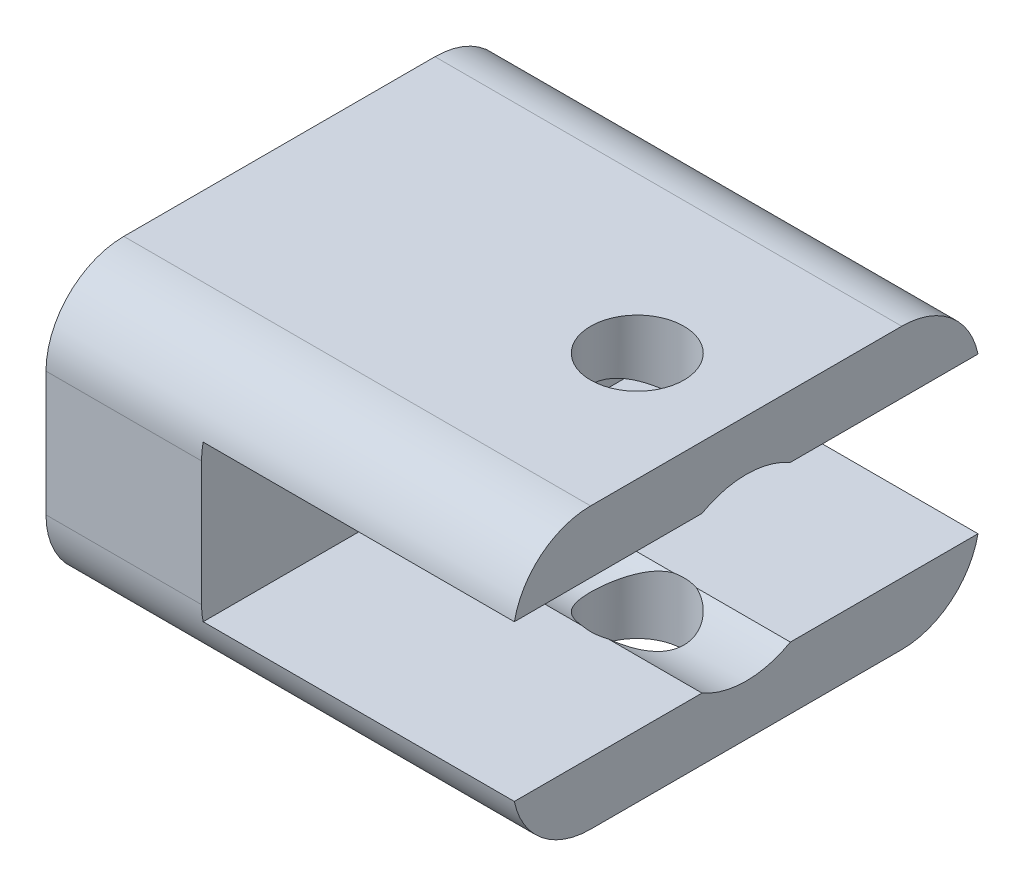
ISO-10303-21;
HEADER;
FILE_DESCRIPTION(('STEP AP214'),'2;1');
FILE_NAME('part.step','',(''),(''),'','','');
FILE_SCHEMA(('AUTOMOTIVE_DESIGN { 1 0 10303 214 1 1 1 1 }'));
ENDSEC;
DATA;
#1=APPLICATION_CONTEXT('core data for automotive mechanical design processes');
#2=APPLICATION_PROTOCOL_DEFINITION('international standard','automotive_design',2000,#1);
#3=PRODUCT_CONTEXT('',#1,'mechanical');
#4=PRODUCT('Part','Part','',(#3));
#5=PRODUCT_RELATED_PRODUCT_CATEGORY('part','',(#4));
#6=PRODUCT_DEFINITION_FORMATION('','',#4);
#7=PRODUCT_DEFINITION_CONTEXT('part definition',#1,'design');
#8=PRODUCT_DEFINITION('design','',#6,#7);
#9=PRODUCT_DEFINITION_SHAPE('','',#8);
#10=(LENGTH_UNIT() NAMED_UNIT(*) SI_UNIT(.MILLI.,.METRE.));
#11=(NAMED_UNIT(*) PLANE_ANGLE_UNIT() SI_UNIT($,.RADIAN.));
#12=(NAMED_UNIT(*) SI_UNIT($,.STERADIAN.) SOLID_ANGLE_UNIT());
#13=UNCERTAINTY_MEASURE_WITH_UNIT(LENGTH_MEASURE(1.E-05),#10,'distance_accuracy_value','');
#14=(GEOMETRIC_REPRESENTATION_CONTEXT(3) GLOBAL_UNCERTAINTY_ASSIGNED_CONTEXT((#13)) GLOBAL_UNIT_ASSIGNED_CONTEXT((#10,
#11,#12)) REPRESENTATION_CONTEXT('',''));
#15=CARTESIAN_POINT('',(0.,0.,0.));
#16=DIRECTION('',(0.,0.,1.));
#17=DIRECTION('',(1.,0.,0.));
#18=AXIS2_PLACEMENT_3D('',#15,#16,#17);
#19=CARTESIAN_POINT('',(10.,9.,15.));
#20=DIRECTION('',(1.,0.,0.));
#21=DIRECTION('',(0.,0.,-1.));
#22=AXIS2_PLACEMENT_3D('',#19,#20,#21);
#23=CYLINDRICAL_SURFACE('',#22,5.75);
#24=DIRECTION('',(1.,0.,0.));
#25=VECTOR('',#24,1.);
#26=CARTESIAN_POINT('',(10.,14.,17.8394541729001));
#27=LINE('',#26,#25);
#28=CARTESIAN_POINT('',(23.9682458365518,14.,17.8394541729001));
#29=VERTEX_POINT('',#28);
#30=CARTESIAN_POINT('',(30.,14.,17.8394541729001));
#31=VERTEX_POINT('',#30);
#32=EDGE_CURVE('E314',#29,#31,#27,.T.);
#33=ORIENTED_EDGE('',*,*,#32,.F.);
#34=CARTESIAN_POINT('',(23.9682458365518,14.,17.8394541729001));
#35=CARTESIAN_POINT('',(24.1320278859983,14.0316901820973,17.7836041525472));
#36=CARTESIAN_POINT('',(24.2894197609395,14.0699565687723,17.7141271284749));
#37=CARTESIAN_POINT('',(24.5884116763139,14.1541284087631,17.5506697656784));
#38=CARTESIAN_POINT('',(24.7300354991613,14.2000220901265,17.4567270624655));
#39=CARTESIAN_POINT('',(24.9947147808843,14.2939649872431,17.247126184123));
#40=CARTESIAN_POINT('',(25.1178092523469,14.3420093898147,17.1315148178157));
#41=CARTESIAN_POINT('',(25.3434550181591,14.4354151123317,16.8806069518322));
#42=CARTESIAN_POINT('',(25.4459942070961,14.4807748402032,16.7452989328942));
#43=CARTESIAN_POINT('',(25.6304103852107,14.5654859160931,16.4531605240063));
#44=CARTESIAN_POINT('',(25.7115504984142,14.6046081292717,16.2957940384179));
#45=CARTESIAN_POINT('',(25.8453895095648,14.6705673597498,15.9670400037451));
#46=CARTESIAN_POINT('',(25.8981172991026,14.6974168525569,15.7956669026088));
#47=CARTESIAN_POINT('',(25.9687818455782,14.7337026977883,15.4612260161125));
#48=CARTESIAN_POINT('',(25.9895388674149,14.7445465015041,15.2989070707829));
#49=CARTESIAN_POINT('',(26.0043083071319,14.7522445273858,14.9727472607448));
#50=CARTESIAN_POINT('',(25.9983318877482,14.749104588564,14.8089070597609));
#51=CARTESIAN_POINT('',(25.961511416091,14.7299949870763,14.4979661850838));
#52=CARTESIAN_POINT('',(25.9326519657824,14.7150495686035,14.3505595781304));
#53=CARTESIAN_POINT('',(25.853815231662,14.6749988347003,14.0629986883217));
#54=CARTESIAN_POINT('',(25.8038371513468,14.6498931360697,13.9228446792268));
#55=CARTESIAN_POINT('',(25.6824149958699,14.590612155831,13.6479441088223));
#56=CARTESIAN_POINT('',(25.6102571926257,14.5561405803477,13.513578839036));
#57=CARTESIAN_POINT('',(25.4473397716739,14.481489920095,13.2583082457945));
#58=CARTESIAN_POINT('',(25.3565633937789,14.4413057029558,13.1374152022474));
#59=CARTESIAN_POINT('',(25.1477981779779,14.3540255359892,12.8988756105851));
#60=CARTESIAN_POINT('',(25.0279338889306,14.3066507627992,12.7829718927738));
#61=CARTESIAN_POINT('',(24.7703948256299,14.2136772221812,12.5723861307345));
#62=CARTESIAN_POINT('',(24.6327435669187,14.1680762114808,12.4776765102836));
#63=CARTESIAN_POINT('',(24.4054371295366,14.1021169933735,12.3478915142216));
#64=CARTESIAN_POINT('',(24.3209603574319,14.0794089569746,12.3047997294767));
#65=CARTESIAN_POINT('',(24.147708354298,14.0371282583402,12.2265921480366));
#66=CARTESIAN_POINT('',(24.058935466988,14.0175539110998,12.1914720606345));
#67=CARTESIAN_POINT('',(23.9682458365518,14.,12.1605458270999));
#68=B_SPLINE_CURVE_WITH_KNOTS('',3,(#34,#35,#36,#37,#38,#39,#40,#41,#42,#43,#44,#45,#46,#47,#48,
#49,#50,#51,#52,#53,#54,#55,#56,#57,#58,#59,#60,#61,#62,#63,#64,#65,#66,#67),.UNSPECIFIED.,.F.,
.F.,(4,2,2,2,2,2,2,2,2,2,2,2,2,2,2,2,4),(0.,0.526399614421645,1.05199420373622,1.57646621899253,
2.10124620461427,2.64225177590212,3.18270617262085,3.67201392293233,4.16111737843767,
4.61190838547287,5.062716395911,5.52989804028133,5.99750209565819,6.51532177569366,
7.03246373742701,7.3245794789891,7.61653761659993),.UNSPECIFIED.);
#69=CARTESIAN_POINT('',(23.9682458365518,14.,12.1605458270999));
#70=VERTEX_POINT('',#69);
#71=EDGE_CURVE('E245',#29,#70,#68,.T.);
#72=ORIENTED_EDGE('',*,*,#71,.T.);
#73=DIRECTION('',(1.,0.,0.));
#74=VECTOR('',#73,1.);
#75=CARTESIAN_POINT('',(10.,14.,12.1605458270999));
#76=LINE('',#75,#74);
#77=CARTESIAN_POINT('',(30.,14.,12.1605458270999));
#78=VERTEX_POINT('',#77);
#79=EDGE_CURVE('E311',#78,#70,#76,.F.);
#80=ORIENTED_EDGE('',*,*,#79,.F.);
#81=CARTESIAN_POINT('',(30.,9.,15.));
#82=DIRECTION('',(1.,0.,0.));
#83=DIRECTION('',(0.,0.,-1.));
#84=AXIS2_PLACEMENT_3D('',#81,#82,#83);
#85=CIRCLE('',#84,5.75);
#86=EDGE_CURVE('E315',#78,#31,#85,.T.);
#87=ORIENTED_EDGE('',*,*,#86,.T.);
#88=EDGE_LOOP('',(#33,#72,#80,#87));
#89=FACE_BOUND('',#88,.T.);
#90=ADVANCED_FACE('F33',(#89),#23,.F.);
#91=CARTESIAN_POINT('',(0.,4.,0.));
#92=DIRECTION('',(0.,-1.,0.));
#93=DIRECTION('',(0.,0.,-1.));
#94=AXIS2_PLACEMENT_3D('',#91,#92,#93);
#95=PLANE('',#94);
#96=DIRECTION('',(0.,0.,1.));
#97=VECTOR('',#96,1.);
#98=CARTESIAN_POINT('',(30.,4.,0.));
#99=LINE('',#98,#97);
#100=CARTESIAN_POINT('',(30.,4.,0.101020514433644));
#101=VERTEX_POINT('',#100);
#102=CARTESIAN_POINT('',(30.,4.,12.1605458270999));
#103=VERTEX_POINT('',#102);
#104=EDGE_CURVE('E230',#101,#103,#99,.T.);
#105=ORIENTED_EDGE('',*,*,#104,.F.);
#106=DIRECTION('',(1.,0.,0.));
#107=VECTOR('',#106,1.);
#108=CARTESIAN_POINT('',(30.,4.,0.101020514433644));
#109=LINE('',#108,#107);
#110=CARTESIAN_POINT('',(10.,4.,0.101020514433644));
#111=VERTEX_POINT('',#110);
#112=EDGE_CURVE('E384',#101,#111,#109,.F.);
#113=ORIENTED_EDGE('',*,*,#112,.T.);
#114=DIRECTION('',(0.,0.,-1.));
#115=VECTOR('',#114,1.);
#116=CARTESIAN_POINT('',(10.,4.,0.));
#117=LINE('',#116,#115);
#118=CARTESIAN_POINT('',(10.,4.,12.0606123086602));
#119=VERTEX_POINT('',#118);
#120=EDGE_CURVE('E209',#119,#111,#117,.T.);
#121=ORIENTED_EDGE('',*,*,#120,.F.);
#122=DIRECTION('',(1.,0.,0.));
#123=VECTOR('',#122,1.);
#124=CARTESIAN_POINT('',(10.,4.,12.0606123086602));
#125=LINE('',#124,#123);
#126=CARTESIAN_POINT('',(22.4000000000001,4.,12.0606123086602));
#127=VERTEX_POINT('',#126);
#128=EDGE_CURVE('E188',#119,#127,#125,.T.);
#129=ORIENTED_EDGE('',*,*,#128,.T.);
#130=CARTESIAN_POINT('',(23.,4.,15.));
#131=DIRECTION('',(0.,-1.,0.));
#132=DIRECTION('',(0.,0.,-1.));
#133=AXIS2_PLACEMENT_3D('',#130,#131,#132);
#134=CIRCLE('',#133,2.99999999999999);
#135=CARTESIAN_POINT('',(23.9682458365518,4.,12.1605458270999));
#136=VERTEX_POINT('',#135);
#137=EDGE_CURVE('E172',#127,#136,#134,.T.);
#138=ORIENTED_EDGE('',*,*,#137,.T.);
#139=DIRECTION('',(1.,0.,0.));
#140=VECTOR('',#139,1.);
#141=CARTESIAN_POINT('',(10.,4.,12.1605458270999));
#142=LINE('',#141,#140);
#143=EDGE_CURVE('E185',#136,#103,#142,.T.);
#144=ORIENTED_EDGE('',*,*,#143,.T.);
#145=EDGE_LOOP('',(#105,#113,#121,#129,#138,#144));
#146=FACE_BOUND('',#145,.T.);
#147=ADVANCED_FACE('F184',(#146),#95,.F.);
#148=CARTESIAN_POINT('',(30.,14.,0.));
#149=DIRECTION('',(0.,1.,0.));
#150=DIRECTION('',(0.,0.,1.));
#151=AXIS2_PLACEMENT_3D('',#148,#149,#150);
#152=PLANE('',#151);
#153=DIRECTION('',(0.,0.,-1.));
#154=VECTOR('',#153,1.);
#155=CARTESIAN_POINT('',(30.,14.,0.));
#156=LINE('',#155,#154);
#157=CARTESIAN_POINT('',(30.,14.,29.8989794855664));
#158=VERTEX_POINT('',#157);
#159=EDGE_CURVE('E208',#158,#31,#156,.T.);
#160=ORIENTED_EDGE('',*,*,#159,.F.);
#161=DIRECTION('',(-1.,0.,0.));
#162=VECTOR('',#161,1.);
#163=CARTESIAN_POINT('',(30.,14.,29.8989794855664));
#164=LINE('',#163,#162);
#165=CARTESIAN_POINT('',(10.,14.,29.8989794855664));
#166=VERTEX_POINT('',#165);
#167=EDGE_CURVE('E11',#158,#166,#164,.T.);
#168=ORIENTED_EDGE('',*,*,#167,.T.);
#169=DIRECTION('',(0.,0.,-1.));
#170=VECTOR('',#169,1.);
#171=CARTESIAN_POINT('',(10.,14.,0.));
#172=LINE('',#171,#170);
#173=CARTESIAN_POINT('',(10.,14.,17.8394541729001));
#174=VERTEX_POINT('',#173);
#175=EDGE_CURVE('E198',#166,#174,#172,.T.);
#176=ORIENTED_EDGE('',*,*,#175,.T.);
#177=CARTESIAN_POINT('',(22.0317541634482,14.,17.8394541729001));
#178=VERTEX_POINT('',#177);
#179=EDGE_CURVE('E200',#174,#178,#27,.T.);
#180=ORIENTED_EDGE('',*,*,#179,.T.);
#181=CARTESIAN_POINT('',(23.,14.,15.));
#182=DIRECTION('',(0.,1.,0.));
#183=DIRECTION('',(0.,0.,1.));
#184=AXIS2_PLACEMENT_3D('',#181,#182,#183);
#185=CIRCLE('',#184,2.99999999999999);
#186=EDGE_CURVE('E324',#178,#29,#185,.T.);
#187=ORIENTED_EDGE('',*,*,#186,.T.);
#188=ORIENTED_EDGE('',*,*,#32,.T.);
#189=EDGE_LOOP('',(#160,#168,#176,#180,#187,#188));
#190=FACE_BOUND('',#189,.T.);
#191=ADVANCED_FACE('F284',(#190),#152,.F.);
#192=CARTESIAN_POINT('',(10.,9.,15.));
#193=DIRECTION('',(1.,0.,0.));
#194=DIRECTION('',(0.,0.,-1.));
#195=AXIS2_PLACEMENT_3D('',#192,#193,#194);
#196=PLANE('',#195);
#197=DIRECTION('',(0.,-1.,0.));
#198=VECTOR('',#197,1.);
#199=CARTESIAN_POINT('',(10.,18.,0.));
#200=LINE('',#199,#198);
#201=CARTESIAN_POINT('',(10.,13.,0.));
#202=VERTEX_POINT('',#201);
#203=CARTESIAN_POINT('',(10.,5.,0.));
#204=VERTEX_POINT('',#203);
#205=EDGE_CURVE('E219',#202,#204,#200,.T.);
#206=ORIENTED_EDGE('',*,*,#205,.F.);
#207=CARTESIAN_POINT('',(10.,13.,5.));
#208=DIRECTION('',(1.,0.,0.));
#209=DIRECTION('',(0.,0.,-1.));
#210=AXIS2_PLACEMENT_3D('',#207,#208,#209);
#211=CIRCLE('',#210,5.);
#212=CARTESIAN_POINT('',(10.,14.,0.101020514433644));
#213=VERTEX_POINT('',#212);
#214=EDGE_CURVE('E400',#202,#213,#211,.T.);
#215=ORIENTED_EDGE('',*,*,#214,.T.);
#216=CARTESIAN_POINT('',(10.,14.,12.1605458270999));
#217=VERTEX_POINT('',#216);
#218=EDGE_CURVE('E194',#217,#213,#172,.T.);
#219=ORIENTED_EDGE('',*,*,#218,.F.);
#220=CARTESIAN_POINT('',(10.,9.,15.));
#221=DIRECTION('',(-1.,0.,0.));
#222=DIRECTION('',(0.,0.,1.));
#223=AXIS2_PLACEMENT_3D('',#220,#221,#222);
#224=CIRCLE('',#223,5.75);
#225=EDGE_CURVE('E335',#217,#174,#224,.T.);
#226=ORIENTED_EDGE('',*,*,#225,.T.);
#227=ORIENTED_EDGE('',*,*,#175,.F.);
#228=CARTESIAN_POINT('',(10.,13.,25.));
#229=DIRECTION('',(1.,0.,0.));
#230=DIRECTION('',(0.,0.,-1.));
#231=AXIS2_PLACEMENT_3D('',#228,#229,#230);
#232=CIRCLE('',#231,5.);
#233=CARTESIAN_POINT('',(10.,13.,30.));
#234=VERTEX_POINT('',#233);
#235=EDGE_CURVE('E405',#166,#234,#232,.T.);
#236=ORIENTED_EDGE('',*,*,#235,.T.);
#237=DIRECTION('',(0.,-1.,0.));
#238=VECTOR('',#237,1.);
#239=CARTESIAN_POINT('',(10.,18.,30.));
#240=LINE('',#239,#238);
#241=CARTESIAN_POINT('',(10.,5.,30.));
#242=VERTEX_POINT('',#241);
#243=EDGE_CURVE('E214',#234,#242,#240,.T.);
#244=ORIENTED_EDGE('',*,*,#243,.T.);
#245=CARTESIAN_POINT('',(10.,5.,25.));
#246=DIRECTION('',(1.,0.,0.));
#247=DIRECTION('',(0.,0.,-1.));
#248=AXIS2_PLACEMENT_3D('',#245,#246,#247);
#249=CIRCLE('',#248,5.);
#250=CARTESIAN_POINT('',(10.,4.,29.8989794855664));
#251=VERTEX_POINT('',#250);
#252=EDGE_CURVE('E374',#242,#251,#249,.T.);
#253=ORIENTED_EDGE('',*,*,#252,.T.);
#254=CARTESIAN_POINT('',(10.,4.,17.9393876913398));
#255=VERTEX_POINT('',#254);
#256=EDGE_CURVE('E215',#251,#255,#117,.T.);
#257=ORIENTED_EDGE('',*,*,#256,.T.);
#258=CARTESIAN_POINT('',(10.,9.,15.));
#259=DIRECTION('',(1.,0.,0.));
#260=DIRECTION('',(0.,0.,-1.));
#261=AXIS2_PLACEMENT_3D('',#258,#259,#260);
#262=CIRCLE('',#261,5.8);
#263=EDGE_CURVE('E222',#255,#119,#262,.T.);
#264=ORIENTED_EDGE('',*,*,#263,.T.);
#265=ORIENTED_EDGE('',*,*,#120,.T.);
#266=CARTESIAN_POINT('',(10.,5.,5.));
#267=DIRECTION('',(1.,0.,0.));
#268=DIRECTION('',(0.,0.,-1.));
#269=AXIS2_PLACEMENT_3D('',#266,#267,#268);
#270=CIRCLE('',#269,5.);
#271=EDGE_CURVE('E402',#111,#204,#270,.T.);
#272=ORIENTED_EDGE('',*,*,#271,.T.);
#273=EDGE_LOOP('',(#206,#215,#219,#226,#227,#236,#244,#253,#257,#264,#265,#272));
#274=FACE_BOUND('',#273,.T.);
#275=ADVANCED_FACE('F372',(#274),#196,.T.);
#276=ORIENTED_EDGE('',*,*,#256,.F.);
#277=DIRECTION('',(-1.,0.,0.));
#278=VECTOR('',#277,1.);
#279=CARTESIAN_POINT('',(10.,4.,29.8989794855664));
#280=LINE('',#279,#278);
#281=CARTESIAN_POINT('',(30.,4.,29.8989794855664));
#282=VERTEX_POINT('',#281);
#283=EDGE_CURVE('E41',#251,#282,#280,.F.);
#284=ORIENTED_EDGE('',*,*,#283,.T.);
#285=CARTESIAN_POINT('',(30.,4.,17.8394541729001));
#286=VERTEX_POINT('',#285);
#287=EDGE_CURVE('E233',#286,#282,#99,.T.);
#288=ORIENTED_EDGE('',*,*,#287,.F.);
#289=DIRECTION('',(1.,0.,0.));
#290=VECTOR('',#289,1.);
#291=CARTESIAN_POINT('',(10.,4.,17.8394541729001));
#292=LINE('',#291,#290);
#293=CARTESIAN_POINT('',(23.9682458365518,4.,17.8394541729001));
#294=VERTEX_POINT('',#293);
#295=EDGE_CURVE('E195',#286,#294,#292,.F.);
#296=ORIENTED_EDGE('',*,*,#295,.T.);
#297=CARTESIAN_POINT('',(23.,4.,15.));
#298=DIRECTION('',(0.,-1.,0.));
#299=DIRECTION('',(0.,0.,-1.));
#300=AXIS2_PLACEMENT_3D('',#297,#298,#299);
#301=CIRCLE('',#300,2.99999999999999);
#302=CARTESIAN_POINT('',(22.4000000007489,4.,17.9393876914927));
#303=VERTEX_POINT('',#302);
#304=EDGE_CURVE('E175',#294,#303,#301,.T.);
#305=ORIENTED_EDGE('',*,*,#304,.T.);
#306=DIRECTION('',(1.,0.,0.));
#307=VECTOR('',#306,1.);
#308=CARTESIAN_POINT('',(10.,4.,17.9393876913398));
#309=LINE('',#308,#307);
#310=EDGE_CURVE('E225',#255,#303,#309,.T.);
#311=ORIENTED_EDGE('',*,*,#310,.F.);
#312=EDGE_LOOP('',(#276,#284,#288,#296,#305,#311));
#313=FACE_BOUND('',#312,.T.);
#314=ADVANCED_FACE('F286',(#313),#95,.F.);
#315=CARTESIAN_POINT('',(30.,4.,30.));
#316=DIRECTION('',(0.,0.,1.));
#317=DIRECTION('',(1.,0.,0.));
#318=AXIS2_PLACEMENT_3D('',#315,#316,#317);
#319=PLANE('',#318);
#320=DIRECTION('',(0.,-1.,0.));
#321=VECTOR('',#320,1.);
#322=CARTESIAN_POINT('',(0.,4.,30.));
#323=LINE('',#322,#321);
#324=CARTESIAN_POINT('',(0.,13.,30.));
#325=VERTEX_POINT('',#324);
#326=CARTESIAN_POINT('',(0.,5.,30.));
#327=VERTEX_POINT('',#326);
#328=EDGE_CURVE('E232',#325,#327,#323,.T.);
#329=ORIENTED_EDGE('',*,*,#328,.T.);
#330=DIRECTION('',(-1.,0.,0.));
#331=VECTOR('',#330,1.);
#332=CARTESIAN_POINT('',(30.,5.,30.));
#333=LINE('',#332,#331);
#334=EDGE_CURVE('E379',#327,#242,#333,.F.);
#335=ORIENTED_EDGE('',*,*,#334,.T.);
#336=ORIENTED_EDGE('',*,*,#243,.F.);
#337=DIRECTION('',(1.,0.,0.));
#338=VECTOR('',#337,1.);
#339=CARTESIAN_POINT('',(0.,13.,30.));
#340=LINE('',#339,#338);
#341=EDGE_CURVE('E380',#234,#325,#340,.F.);
#342=ORIENTED_EDGE('',*,*,#341,.T.);
#343=EDGE_LOOP('',(#329,#335,#336,#342));
#344=FACE_BOUND('',#343,.T.);
#345=ADVANCED_FACE('F441',(#344),#319,.T.);
#346=CARTESIAN_POINT('',(30.,4.,0.));
#347=DIRECTION('',(1.,0.,0.));
#348=DIRECTION('',(0.,0.,-1.));
#349=AXIS2_PLACEMENT_3D('',#346,#347,#348);
#350=PLANE('',#349);
#351=DIRECTION('',(0.,0.,1.));
#352=VECTOR('',#351,1.);
#353=CARTESIAN_POINT('',(30.,0.,0.));
#354=LINE('',#353,#352);
#355=CARTESIAN_POINT('',(30.,0.,5.));
#356=VERTEX_POINT('',#355);
#357=CARTESIAN_POINT('',(30.,0.,25.));
#358=VERTEX_POINT('',#357);
#359=EDGE_CURVE('E236',#356,#358,#354,.T.);
#360=ORIENTED_EDGE('',*,*,#359,.F.);
#361=CARTESIAN_POINT('',(30.,5.,5.));
#362=DIRECTION('',(1.,0.,0.));
#363=DIRECTION('',(0.,0.,-1.));
#364=AXIS2_PLACEMENT_3D('',#361,#362,#363);
#365=CIRCLE('',#364,5.);
#366=EDGE_CURVE('E48',#356,#101,#365,.T.);
#367=ORIENTED_EDGE('',*,*,#366,.T.);
#368=ORIENTED_EDGE('',*,*,#104,.T.);
#369=EDGE_CURVE('E193',#286,#103,#85,.T.);
#370=ORIENTED_EDGE('',*,*,#369,.F.);
#371=ORIENTED_EDGE('',*,*,#287,.T.);
#372=CARTESIAN_POINT('',(30.,5.,25.));
#373=DIRECTION('',(1.,0.,0.));
#374=DIRECTION('',(0.,0.,-1.));
#375=AXIS2_PLACEMENT_3D('',#372,#373,#374);
#376=CIRCLE('',#375,5.);
#377=EDGE_CURVE('E378',#282,#358,#376,.T.);
#378=ORIENTED_EDGE('',*,*,#377,.T.);
#379=EDGE_LOOP('',(#360,#367,#368,#370,#371,#378));
#380=FACE_BOUND('',#379,.T.);
#381=ADVANCED_FACE('F540',(#380),#350,.T.);
#382=CARTESIAN_POINT('',(0.,4.,0.));
#383=DIRECTION('',(0.,0.,-1.));
#384=DIRECTION('',(-1.,0.,0.));
#385=AXIS2_PLACEMENT_3D('',#382,#383,#384);
#386=PLANE('',#385);
#387=DIRECTION('',(0.,-1.,0.));
#388=VECTOR('',#387,1.);
#389=CARTESIAN_POINT('',(0.,4.,0.));
#390=LINE('',#389,#388);
#391=CARTESIAN_POINT('',(0.,13.,0.));
#392=VERTEX_POINT('',#391);
#393=CARTESIAN_POINT('',(0.,5.,0.));
#394=VERTEX_POINT('',#393);
#395=EDGE_CURVE('E239',#392,#394,#390,.T.);
#396=ORIENTED_EDGE('',*,*,#395,.F.);
#397=DIRECTION('',(-1.,0.,0.));
#398=VECTOR('',#397,1.);
#399=CARTESIAN_POINT('',(30.,13.,0.));
#400=LINE('',#399,#398);
#401=EDGE_CURVE('E407',#392,#202,#400,.F.);
#402=ORIENTED_EDGE('',*,*,#401,.T.);
#403=ORIENTED_EDGE('',*,*,#205,.T.);
#404=DIRECTION('',(1.,0.,0.));
#405=VECTOR('',#404,1.);
#406=CARTESIAN_POINT('',(0.,5.,0.));
#407=LINE('',#406,#405);
#408=EDGE_CURVE('E409',#204,#394,#407,.F.);
#409=ORIENTED_EDGE('',*,*,#408,.T.);
#410=EDGE_LOOP('',(#396,#402,#403,#409));
#411=FACE_BOUND('',#410,.T.);
#412=ADVANCED_FACE('F549',(#411),#386,.T.);
#413=CARTESIAN_POINT('',(0.,4.,30.));
#414=DIRECTION('',(-1.,0.,0.));
#415=DIRECTION('',(0.,0.,1.));
#416=AXIS2_PLACEMENT_3D('',#413,#414,#415);
#417=PLANE('',#416);
#418=CARTESIAN_POINT('',(0.,9.,15.));
#419=DIRECTION('',(-1.,0.,0.));
#420=DIRECTION('',(0.,0.,1.));
#421=AXIS2_PLACEMENT_3D('',#418,#419,#420);
#422=CIRCLE('',#421,2.75);
#423=CARTESIAN_POINT('',(0.,9.,17.75));
#424=VERTEX_POINT('',#423);
#425=EDGE_CURVE('E330',#424,#424,#422,.T.);
#426=ORIENTED_EDGE('',*,*,#425,.F.);
#427=EDGE_LOOP('',(#426));
#428=FACE_BOUND('',#427,.T.);
#429=DIRECTION('',(0.,0.,1.));
#430=VECTOR('',#429,1.);
#431=CARTESIAN_POINT('',(0.,18.,30.));
#432=LINE('',#431,#430);
#433=CARTESIAN_POINT('',(0.,18.,5.));
#434=VERTEX_POINT('',#433);
#435=CARTESIAN_POINT('',(0.,18.,25.));
#436=VERTEX_POINT('',#435);
#437=EDGE_CURVE('E211',#434,#436,#432,.T.);
#438=ORIENTED_EDGE('',*,*,#437,.F.);
#439=CARTESIAN_POINT('',(0.,13.,5.));
#440=DIRECTION('',(-1.,0.,0.));
#441=DIRECTION('',(0.,0.,1.));
#442=AXIS2_PLACEMENT_3D('',#439,#440,#441);
#443=CIRCLE('',#442,5.);
#444=EDGE_CURVE('E411',#434,#392,#443,.T.);
#445=ORIENTED_EDGE('',*,*,#444,.T.);
#446=ORIENTED_EDGE('',*,*,#395,.T.);
#447=CARTESIAN_POINT('',(0.,5.,5.));
#448=DIRECTION('',(-1.,0.,0.));
#449=DIRECTION('',(0.,0.,1.));
#450=AXIS2_PLACEMENT_3D('',#447,#448,#449);
#451=CIRCLE('',#450,5.);
#452=CARTESIAN_POINT('',(0.,0.,5.));
#453=VERTEX_POINT('',#452);
#454=EDGE_CURVE('E413',#394,#453,#451,.T.);
#455=ORIENTED_EDGE('',*,*,#454,.T.);
#456=DIRECTION('',(0.,0.,-1.));
#457=VECTOR('',#456,1.);
#458=CARTESIAN_POINT('',(0.,0.,30.));
#459=LINE('',#458,#457);
#460=CARTESIAN_POINT('',(0.,0.,25.));
#461=VERTEX_POINT('',#460);
#462=EDGE_CURVE('E228',#461,#453,#459,.T.);
#463=ORIENTED_EDGE('',*,*,#462,.F.);
#464=CARTESIAN_POINT('',(0.,5.,25.));
#465=DIRECTION('',(-1.,0.,0.));
#466=DIRECTION('',(0.,0.,1.));
#467=AXIS2_PLACEMENT_3D('',#464,#465,#466);
#468=CIRCLE('',#467,5.);
#469=EDGE_CURVE('E415',#461,#327,#468,.T.);
#470=ORIENTED_EDGE('',*,*,#469,.T.);
#471=ORIENTED_EDGE('',*,*,#328,.F.);
#472=CARTESIAN_POINT('',(0.,13.,25.));
#473=DIRECTION('',(-1.,0.,0.));
#474=DIRECTION('',(0.,0.,1.));
#475=AXIS2_PLACEMENT_3D('',#472,#473,#474);
#476=CIRCLE('',#475,5.);
#477=EDGE_CURVE('E417',#325,#436,#476,.T.);
#478=ORIENTED_EDGE('',*,*,#477,.T.);
#479=EDGE_LOOP('',(#438,#445,#446,#455,#463,#470,#471,#478));
#480=FACE_BOUND('',#479,.T.);
#481=ADVANCED_FACE('F434',(#428,#480),#417,.T.);
#482=CARTESIAN_POINT('',(0.,0.,0.));
#483=DIRECTION('',(0.,-1.,0.));
#484=DIRECTION('',(0.,0.,-1.));
#485=AXIS2_PLACEMENT_3D('',#482,#483,#484);
#486=PLANE('',#485);
#487=CARTESIAN_POINT('',(23.,0.,15.));
#488=DIRECTION('',(0.,-1.,0.));
#489=DIRECTION('',(0.,0.,-1.));
#490=AXIS2_PLACEMENT_3D('',#487,#488,#489);
#491=CIRCLE('',#490,2.99999999999999);
#492=CARTESIAN_POINT('',(23.,0.,12.));
#493=VERTEX_POINT('',#492);
#494=EDGE_CURVE('E179',#493,#493,#491,.T.);
#495=ORIENTED_EDGE('',*,*,#494,.F.);
#496=EDGE_LOOP('',(#495));
#497=FACE_BOUND('',#496,.T.);
#498=ORIENTED_EDGE('',*,*,#462,.T.);
#499=DIRECTION('',(1.,0.,0.));
#500=VECTOR('',#499,1.);
#501=CARTESIAN_POINT('',(0.,0.,5.));
#502=LINE('',#501,#500);
#503=EDGE_CURVE('E388',#453,#356,#502,.T.);
#504=ORIENTED_EDGE('',*,*,#503,.T.);
#505=ORIENTED_EDGE('',*,*,#359,.T.);
#506=DIRECTION('',(-1.,0.,0.));
#507=VECTOR('',#506,1.);
#508=CARTESIAN_POINT('',(0.,0.,25.));
#509=LINE('',#508,#507);
#510=EDGE_CURVE('E391',#358,#461,#509,.T.);
#511=ORIENTED_EDGE('',*,*,#510,.T.);
#512=EDGE_LOOP('',(#498,#504,#505,#511));
#513=FACE_BOUND('',#512,.T.);
#514=ADVANCED_FACE('F494',(#497,#513),#486,.T.);
#515=CARTESIAN_POINT('',(10.,9.,15.));
#516=DIRECTION('',(1.,0.,0.));
#517=DIRECTION('',(0.,0.,-1.));
#518=AXIS2_PLACEMENT_3D('',#515,#516,#517);
#519=CYLINDRICAL_SURFACE('',#518,5.8);
#520=ORIENTED_EDGE('',*,*,#310,.T.);
#521=CARTESIAN_POINT('',(22.4000000000001,4.,17.9393876913398));
#522=CARTESIAN_POINT('',(22.3178243780127,3.99015165958801,17.9226166924112));
#523=CARTESIAN_POINT('',(22.2366393312063,3.97839889714779,17.9024513478854));
#524=CARTESIAN_POINT('',(22.0767940122755,3.95162061410833,17.8556293151123));
#525=CARTESIAN_POINT('',(21.9981315391759,3.93659804080942,17.8289784701453));
#526=CARTESIAN_POINT('',(21.7672879573463,3.88755849575791,17.7399832341646));
#527=CARTESIAN_POINT('',(21.6194278984958,3.84946166227583,17.6684242642837));
#528=CARTESIAN_POINT('',(21.3390785169348,3.76734597833893,17.5035498911457));
#529=CARTESIAN_POINT('',(21.2065434716306,3.72334563689174,17.4103018440861));
#530=CARTESIAN_POINT('',(20.958215704987,3.63385998451861,17.2039074970108));
#531=CARTESIAN_POINT('',(20.8424484202372,3.58837254317384,17.0907315309239));
#532=CARTESIAN_POINT('',(20.6219394738256,3.49687964870841,16.8371656481749));
#533=CARTESIAN_POINT('',(20.5187289153882,3.45110304774183,16.6953527235436));
#534=CARTESIAN_POINT('',(20.3378076955882,3.36787662128397,16.3941107296013));
#535=CARTESIAN_POINT('',(20.2600804061046,3.3304213711819,16.2346932386294));
#536=CARTESIAN_POINT('',(20.1362990033531,3.26955416637997,15.9099518664589));
#537=CARTESIAN_POINT('',(20.0889682772163,3.24558234062288,15.745223776113));
#538=CARTESIAN_POINT('',(20.0230444423797,3.21195716512564,15.4087285117108));
#539=CARTESIAN_POINT('',(20.0044285514191,3.20229246440263,15.2369670291192));
#540=CARTESIAN_POINT('',(19.9973619195903,3.19863377387484,14.9106701072741));
#541=CARTESIAN_POINT('',(20.0059667910539,3.20311011542326,14.7562069753966));
#542=CARTESIAN_POINT('',(20.0466080024361,3.2239962711406,14.4512443423331));
#543=CARTESIAN_POINT('',(20.0786436424278,3.24040572884191,14.3007447228877));
#544=CARTESIAN_POINT('',(20.1640159322423,3.2832286415739,14.0101618864204));
#545=CARTESIAN_POINT('',(20.2170029889085,3.30947756024014,13.869950390512));
#546=CARTESIAN_POINT('',(20.3423642718098,3.36972367771017,13.6003232600596));
#547=CARTESIAN_POINT('',(20.4147421611178,3.40372234031716,13.4709096713846));
#548=CARTESIAN_POINT('',(20.5838956400993,3.47991207308526,13.2144955948866));
#549=CARTESIAN_POINT('',(20.6822360508572,3.52255661354755,13.0886637602171));
#550=CARTESIAN_POINT('',(20.8972272445931,3.61000832695241,12.8543847602788));
#551=CARTESIAN_POINT('',(21.0139009964765,3.65481816324893,12.74595975235));
#552=CARTESIAN_POINT('',(21.2750066085263,3.74649869632532,12.5393806154163));
#553=CARTESIAN_POINT('',(21.4210106305856,3.79317373178462,12.4431182866965));
#554=CARTESIAN_POINT('',(21.7292230669132,3.87816871378141,12.2768407231297));
#555=CARTESIAN_POINT('',(21.8913841985366,3.91651205246775,12.2067515953723));
#556=CARTESIAN_POINT('',(22.1150277123427,3.95815854173342,12.1328987030315));
#557=CARTESIAN_POINT('',(22.1712657519739,3.96773959802103,12.1161374902261));
#558=CARTESIAN_POINT('',(22.2848404134453,3.98519076935275,12.0858980532677));
#559=CARTESIAN_POINT('',(22.34217635497,3.99306190885387,12.0724178627799));
#560=CARTESIAN_POINT('',(22.4000000007489,4.00000000008987,12.0606123085073));
#561=B_SPLINE_CURVE_WITH_KNOTS('',3,(#521,#522,#523,#524,#525,#526,#527,#528,#529,#530,#531,
#532,#533,#534,#535,#536,#537,#538,#539,#540,#541,#542,#543,#544,#545,#546,#547,#548,#549,#550,
#551,#552,#553,#554,#555,#556,#557,#558,#559,#560),.UNSPECIFIED.,.F.,.F.,(4,2,2,2,2,2,2,2,2,2,2,
2,2,2,2,2,2,2,2,4),(0.,0.253124577308216,0.506021934351963,1.0093104591731,1.51105639359677,
2.01355567581359,2.55467327417677,3.09543708118853,3.61167527256088,4.12750367110352,
4.58951791353425,5.05151835518206,5.50611487347336,5.96079732906368,6.4546558267725,
6.94913806161045,7.48958830742751,8.02850099168498,8.20678181758177,8.38495553425814),.UNSPECIFIED.);
#562=EDGE_CURVE('E189',#303,#127,#561,.T.);
#563=ORIENTED_EDGE('',*,*,#562,.T.);
#564=ORIENTED_EDGE('',*,*,#128,.F.);
#565=ORIENTED_EDGE('',*,*,#263,.F.);
#566=EDGE_LOOP('',(#520,#563,#564,#565));
#567=FACE_BOUND('',#566,.T.);
#568=ADVANCED_FACE('F352',(#567),#519,.F.);
#569=CARTESIAN_POINT('',(0.,18.,0.));
#570=DIRECTION('',(0.,-1.,0.));
#571=DIRECTION('',(0.,0.,-1.));
#572=AXIS2_PLACEMENT_3D('',#569,#570,#571);
#573=PLANE('',#572);
#574=CARTESIAN_POINT('',(23.,18.,15.));
#575=DIRECTION('',(0.,1.,0.));
#576=DIRECTION('',(0.,0.,1.));
#577=AXIS2_PLACEMENT_3D('',#574,#575,#576);
#578=CIRCLE('',#577,2.99999999999999);
#579=CARTESIAN_POINT('',(23.,18.,18.));
#580=VERTEX_POINT('',#579);
#581=EDGE_CURVE('E343',#580,#580,#578,.T.);
#582=ORIENTED_EDGE('',*,*,#581,.F.);
#583=EDGE_LOOP('',(#582));
#584=FACE_BOUND('',#583,.T.);
#585=DIRECTION('',(0.,0.,1.));
#586=VECTOR('',#585,1.);
#587=CARTESIAN_POINT('',(30.,18.,30.));
#588=LINE('',#587,#586);
#589=CARTESIAN_POINT('',(30.,18.,5.));
#590=VERTEX_POINT('',#589);
#591=CARTESIAN_POINT('',(30.,18.,25.));
#592=VERTEX_POINT('',#591);
#593=EDGE_CURVE('E204',#590,#592,#588,.T.);
#594=ORIENTED_EDGE('',*,*,#593,.F.);
#595=DIRECTION('',(-1.,0.,0.));
#596=VECTOR('',#595,1.);
#597=CARTESIAN_POINT('',(0.,18.,5.));
#598=LINE('',#597,#596);
#599=EDGE_CURVE('E419',#590,#434,#598,.T.);
#600=ORIENTED_EDGE('',*,*,#599,.T.);
#601=ORIENTED_EDGE('',*,*,#437,.T.);
#602=DIRECTION('',(1.,0.,0.));
#603=VECTOR('',#602,1.);
#604=CARTESIAN_POINT('',(30.,18.,25.));
#605=LINE('',#604,#603);
#606=EDGE_CURVE('E253',#436,#592,#605,.T.);
#607=ORIENTED_EDGE('',*,*,#606,.T.);
#608=EDGE_LOOP('',(#594,#600,#601,#607));
#609=FACE_BOUND('',#608,.T.);
#610=ADVANCED_FACE('F425',(#584,#609),#573,.F.);
#611=ORIENTED_EDGE('',*,*,#218,.T.);
#612=DIRECTION('',(1.,0.,0.));
#613=VECTOR('',#612,1.);
#614=CARTESIAN_POINT('',(10.,14.,0.101020514433644));
#615=LINE('',#614,#613);
#616=CARTESIAN_POINT('',(30.,14.,0.101020514433644));
#617=VERTEX_POINT('',#616);
#618=EDGE_CURVE('E398',#213,#617,#615,.T.);
#619=ORIENTED_EDGE('',*,*,#618,.T.);
#620=EDGE_CURVE('E207',#78,#617,#156,.T.);
#621=ORIENTED_EDGE('',*,*,#620,.F.);
#622=ORIENTED_EDGE('',*,*,#79,.T.);
#623=CARTESIAN_POINT('',(23.,14.,15.));
#624=DIRECTION('',(0.,1.,0.));
#625=DIRECTION('',(0.,0.,1.));
#626=AXIS2_PLACEMENT_3D('',#623,#624,#625);
#627=CIRCLE('',#626,2.99999999999999);
#628=CARTESIAN_POINT('',(22.0317541634482,14.,12.1605458270999));
#629=VERTEX_POINT('',#628);
#630=EDGE_CURVE('E340',#70,#629,#627,.T.);
#631=ORIENTED_EDGE('',*,*,#630,.T.);
#632=EDGE_CURVE('E302',#629,#217,#76,.F.);
#633=ORIENTED_EDGE('',*,*,#632,.T.);
#634=EDGE_LOOP('',(#611,#619,#621,#622,#631,#633));
#635=FACE_BOUND('',#634,.T.);
#636=ADVANCED_FACE('F296',(#635),#152,.F.);
#637=CARTESIAN_POINT('',(30.,0.,0.));
#638=DIRECTION('',(-1.,0.,0.));
#639=DIRECTION('',(0.,0.,1.));
#640=AXIS2_PLACEMENT_3D('',#637,#638,#639);
#641=PLANE('',#640);
#642=ORIENTED_EDGE('',*,*,#620,.T.);
#643=CARTESIAN_POINT('',(30.,13.,5.));
#644=DIRECTION('',(-1.,0.,0.));
#645=DIRECTION('',(0.,0.,1.));
#646=AXIS2_PLACEMENT_3D('',#643,#644,#645);
#647=CIRCLE('',#646,5.);
#648=EDGE_CURVE('E394',#617,#590,#647,.F.);
#649=ORIENTED_EDGE('',*,*,#648,.T.);
#650=ORIENTED_EDGE('',*,*,#593,.T.);
#651=CARTESIAN_POINT('',(30.,13.,25.));
#652=DIRECTION('',(-1.,0.,0.));
#653=DIRECTION('',(0.,0.,1.));
#654=AXIS2_PLACEMENT_3D('',#651,#652,#653);
#655=CIRCLE('',#654,5.);
#656=EDGE_CURVE('E396',#592,#158,#655,.F.);
#657=ORIENTED_EDGE('',*,*,#656,.T.);
#658=ORIENTED_EDGE('',*,*,#159,.T.);
#659=ORIENTED_EDGE('',*,*,#86,.F.);
#660=EDGE_LOOP('',(#642,#649,#650,#657,#658,#659));
#661=FACE_BOUND('',#660,.T.);
#662=ADVANCED_FACE('F291',(#661),#641,.F.);
#663=ORIENTED_EDGE('',*,*,#632,.F.);
#664=CARTESIAN_POINT('',(22.0317541634482,14.,12.1605458270999));
#665=CARTESIAN_POINT('',(21.8679721140017,14.0316901820973,12.2163958474528));
#666=CARTESIAN_POINT('',(21.7105802390605,14.0699565687723,12.2858728715251));
#667=CARTESIAN_POINT('',(21.4115883236861,14.1541284087631,12.4493302343216));
#668=CARTESIAN_POINT('',(21.2699645008387,14.2000220901265,12.5432729375345));
#669=CARTESIAN_POINT('',(21.0052852191157,14.2939649872431,12.752873815877));
#670=CARTESIAN_POINT('',(20.8821907476531,14.3420093898147,12.8684851821843));
#671=CARTESIAN_POINT('',(20.6565449818409,14.4354151123317,13.1193930481678));
#672=CARTESIAN_POINT('',(20.5540057929039,14.4807748402032,13.2547010671058));
#673=CARTESIAN_POINT('',(20.3695896147893,14.5654859160931,13.5468394759937));
#674=CARTESIAN_POINT('',(20.2884495015858,14.6046081292717,13.7042059615821));
#675=CARTESIAN_POINT('',(20.1546104904352,14.6705673597498,14.0329599962549));
#676=CARTESIAN_POINT('',(20.1018827008974,14.6974168525569,14.2043330973912));
#677=CARTESIAN_POINT('',(20.0312181544218,14.7337026977883,14.5387739838875));
#678=CARTESIAN_POINT('',(20.0104611325851,14.7445465015041,14.7010929292171));
#679=CARTESIAN_POINT('',(19.9956916928681,14.7522445273858,15.0272527392552));
#680=CARTESIAN_POINT('',(20.0016681122518,14.749104588564,15.1910929402391));
#681=CARTESIAN_POINT('',(20.038488583909,14.7299949870763,15.5020338149161));
#682=CARTESIAN_POINT('',(20.0673480342176,14.7150495686035,15.6494404218696));
#683=CARTESIAN_POINT('',(20.146184768338,14.6749988347003,15.9370013116783));
#684=CARTESIAN_POINT('',(20.1961628486532,14.6498931360697,16.0771553207732));
#685=CARTESIAN_POINT('',(20.3175850041301,14.590612155831,16.3520558911777));
#686=CARTESIAN_POINT('',(20.3897428073743,14.5561405803477,16.486421160964));
#687=CARTESIAN_POINT('',(20.5526602283261,14.481489920095,16.7416917542055));
#688=CARTESIAN_POINT('',(20.6434366062211,14.4413057029558,16.8625847977526));
#689=CARTESIAN_POINT('',(20.8522018220221,14.3540255359892,17.1011243894149));
#690=CARTESIAN_POINT('',(20.9720661110694,14.3066507627992,17.2170281072262));
#691=CARTESIAN_POINT('',(21.2296051743701,14.2136772221812,17.4276138692655));
#692=CARTESIAN_POINT('',(21.3672564330813,14.1680762114808,17.5223234897164));
#693=CARTESIAN_POINT('',(21.5945628704634,14.1021169933735,17.6521084857783));
#694=CARTESIAN_POINT('',(21.6790396425681,14.0794089569746,17.6952002705233));
#695=CARTESIAN_POINT('',(21.852291645702,14.0371282583402,17.7734078519634));
#696=CARTESIAN_POINT('',(21.941064533012,14.0175539110998,17.8085279393655));
#697=CARTESIAN_POINT('',(22.0317541634482,14.,17.8394541729001));
#698=B_SPLINE_CURVE_WITH_KNOTS('',3,(#664,#665,#666,#667,#668,#669,#670,#671,#672,#673,#674,
#675,#676,#677,#678,#679,#680,#681,#682,#683,#684,#685,#686,#687,#688,#689,#690,#691,#692,#693,
#694,#695,#696,#697),.UNSPECIFIED.,.F.,.F.,(4,2,2,2,2,2,2,2,2,2,2,2,2,2,2,2,4),(0.,
0.526399614421646,1.05199420373622,1.57646621899253,2.10124620461426,2.64225177590212,
3.18270617262085,3.67201392293233,4.16111737843767,4.61190838547287,5.06271639591099,
5.52989804028134,5.99750209565819,6.51532177569366,7.032463737427,7.32457947898909,
7.61653761659992),.UNSPECIFIED.);
#699=EDGE_CURVE('E242',#629,#178,#698,.T.);
#700=ORIENTED_EDGE('',*,*,#699,.T.);
#701=ORIENTED_EDGE('',*,*,#179,.F.);
#702=CARTESIAN_POINT('',(10.,9.,15.));
#703=DIRECTION('',(1.,0.,0.));
#704=DIRECTION('',(0.,0.,-1.));
#705=AXIS2_PLACEMENT_3D('',#702,#703,#704);
#706=CIRCLE('',#705,5.75);
#707=EDGE_CURVE('E306',#217,#174,#706,.T.);
#708=ORIENTED_EDGE('',*,*,#707,.F.);
#709=EDGE_LOOP('',(#663,#700,#701,#708));
#710=FACE_BOUND('',#709,.T.);
#711=ADVANCED_FACE('F280',(#710),#23,.F.);
#712=ORIENTED_EDGE('',*,*,#143,.F.);
#713=CARTESIAN_POINT('',(23.9682458365518,4.,12.1605458270999));
#714=CARTESIAN_POINT('',(24.1320278859983,3.96830981790268,12.2163958474528));
#715=CARTESIAN_POINT('',(24.2894197609395,3.93004343122774,12.2858728715251));
#716=CARTESIAN_POINT('',(24.5884116763139,3.84587159123691,12.4493302343216));
#717=CARTESIAN_POINT('',(24.7300354991613,3.79997790987355,12.5432729375345));
#718=CARTESIAN_POINT('',(24.9947147808843,3.7060350127569,12.752873815877));
#719=CARTESIAN_POINT('',(25.1178092523469,3.65799061018534,12.8684851821843));
#720=CARTESIAN_POINT('',(25.3434550181591,3.56458488766826,13.1193930481677));
#721=CARTESIAN_POINT('',(25.4459942070961,3.51922515979682,13.2547010671058));
#722=CARTESIAN_POINT('',(25.6304103852107,3.43451408390687,13.5468394759937));
#723=CARTESIAN_POINT('',(25.7115504984142,3.39539187072835,13.7042059615821));
#724=CARTESIAN_POINT('',(25.8453895095648,3.32943264025022,14.0329599962549));
#725=CARTESIAN_POINT('',(25.8981172991026,3.30258314744311,14.2043330973912));
#726=CARTESIAN_POINT('',(25.9687818455781,3.26629730221168,14.5387739838875));
#727=CARTESIAN_POINT('',(25.9895388674148,3.25545349849592,14.7010929292171));
#728=CARTESIAN_POINT('',(26.0043083071319,3.24775547261418,15.0272527392551));
#729=CARTESIAN_POINT('',(25.9983318877482,3.25089541143603,15.1910929402391));
#730=CARTESIAN_POINT('',(25.961511416091,3.27000501292368,15.5020338149161));
#731=CARTESIAN_POINT('',(25.9326519657824,3.28495043139651,15.6494404218696));
#732=CARTESIAN_POINT('',(25.853815231662,3.32500116529966,15.9370013116783));
#733=CARTESIAN_POINT('',(25.8038371513468,3.35010686393025,16.0771553207732));
#734=CARTESIAN_POINT('',(25.6824149958699,3.40938784416901,16.3520558911777));
#735=CARTESIAN_POINT('',(25.6102571926257,3.44385941965227,16.486421160964));
#736=CARTESIAN_POINT('',(25.4473397716739,3.51851007990495,16.7416917542055));
#737=CARTESIAN_POINT('',(25.3565633937789,3.55869429704423,16.8625847977526));
#738=CARTESIAN_POINT('',(25.1477981779779,3.64597446401084,17.1011243894149));
#739=CARTESIAN_POINT('',(25.0279338889306,3.69334923720075,17.2170281072261));
#740=CARTESIAN_POINT('',(24.7703948256299,3.78632277781875,17.4276138692655));
#741=CARTESIAN_POINT('',(24.6327435669187,3.83192378851915,17.5223234897164));
#742=CARTESIAN_POINT('',(24.4054371295366,3.89788300662649,17.6521084857783));
#743=CARTESIAN_POINT('',(24.3209603574319,3.92059104302542,17.6952002705233));
#744=CARTESIAN_POINT('',(24.147708354298,3.96287174165982,17.7734078519634));
#745=CARTESIAN_POINT('',(24.058935466988,3.98244608890021,17.8085279393655));
#746=CARTESIAN_POINT('',(23.9682458365518,4.,17.8394541729001));
#747=B_SPLINE_CURVE_WITH_KNOTS('',3,(#713,#714,#715,#716,#717,#718,#719,#720,#721,#722,#723,
#724,#725,#726,#727,#728,#729,#730,#731,#732,#733,#734,#735,#736,#737,#738,#739,#740,#741,#742,
#743,#744,#745,#746),.UNSPECIFIED.,.F.,.F.,(4,2,2,2,2,2,2,2,2,2,2,2,2,2,2,2,4),(0.,
0.526399614421644,1.05199420373622,1.57646621899253,2.10124620461426,2.64225177590211,
3.18270617262084,3.67201392293232,4.16111737843766,4.61190838547286,5.06271639591098,
5.52989804028132,5.99750209565817,6.51532177569364,7.03246373742699,7.32457947898909,
7.61653761659994),.UNSPECIFIED.);
#748=EDGE_CURVE('E169',#136,#294,#747,.T.);
#749=ORIENTED_EDGE('',*,*,#748,.T.);
#750=ORIENTED_EDGE('',*,*,#295,.F.);
#751=ORIENTED_EDGE('',*,*,#369,.T.);
#752=EDGE_LOOP('',(#712,#749,#750,#751));
#753=FACE_BOUND('',#752,.T.);
#754=ADVANCED_FACE('F191',(#753),#23,.F.);
#755=CARTESIAN_POINT('',(7.,9.,15.));
#756=DIRECTION('',(1.,0.,0.));
#757=DIRECTION('',(0.,0.,-1.));
#758=AXIS2_PLACEMENT_3D('',#755,#756,#757);
#759=CONICAL_SURFACE('',#758,2.75,0.785398163397448);
#760=ORIENTED_EDGE('',*,*,#707,.T.);
#761=ORIENTED_EDGE('',*,*,#225,.F.);
#762=EDGE_LOOP('',(#760,#761));
#763=FACE_BOUND('',#762,.T.);
#764=CARTESIAN_POINT('',(7.,9.,15.));
#765=DIRECTION('',(-1.,0.,0.));
#766=DIRECTION('',(0.,0.,1.));
#767=AXIS2_PLACEMENT_3D('',#764,#765,#766);
#768=CIRCLE('',#767,2.75);
#769=CARTESIAN_POINT('',(7.,9.,17.75));
#770=VERTEX_POINT('',#769);
#771=EDGE_CURVE('E328',#770,#770,#768,.T.);
#772=ORIENTED_EDGE('',*,*,#771,.T.);
#773=EDGE_LOOP('',(#772));
#774=FACE_BOUND('',#773,.T.);
#775=ADVANCED_FACE('F289',(#763,#774),#759,.F.);
#776=CARTESIAN_POINT('',(10.,9.,15.));
#777=DIRECTION('',(-1.,0.,0.));
#778=DIRECTION('',(0.,0.,1.));
#779=AXIS2_PLACEMENT_3D('',#776,#777,#778);
#780=CYLINDRICAL_SURFACE('',#779,2.75);
#781=ORIENTED_EDGE('',*,*,#771,.F.);
#782=EDGE_LOOP('',(#781));
#783=FACE_BOUND('',#782,.T.);
#784=ORIENTED_EDGE('',*,*,#425,.T.);
#785=EDGE_LOOP('',(#784));
#786=FACE_BOUND('',#785,.T.);
#787=ADVANCED_FACE('F445',(#783,#786),#780,.F.);
#788=CARTESIAN_POINT('',(23.,18.,15.));
#789=DIRECTION('',(0.,1.,0.));
#790=DIRECTION('',(0.,0.,1.));
#791=AXIS2_PLACEMENT_3D('',#788,#789,#790);
#792=CYLINDRICAL_SURFACE('',#791,2.99999999999999);
#793=ORIENTED_EDGE('',*,*,#581,.T.);
#794=EDGE_LOOP('',(#793));
#795=FACE_BOUND('',#794,.T.);
#796=ORIENTED_EDGE('',*,*,#71,.F.);
#797=ORIENTED_EDGE('',*,*,#186,.F.);
#798=ORIENTED_EDGE('',*,*,#699,.F.);
#799=ORIENTED_EDGE('',*,*,#630,.F.);
#800=EDGE_LOOP('',(#796,#797,#798,#799));
#801=FACE_BOUND('',#800,.T.);
#802=ADVANCED_FACE('F358',(#795,#801),#792,.F.);
#803=CARTESIAN_POINT('',(23.,0.,15.));
#804=DIRECTION('',(0.,-1.,0.));
#805=DIRECTION('',(0.,0.,-1.));
#806=AXIS2_PLACEMENT_3D('',#803,#804,#805);
#807=CYLINDRICAL_SURFACE('',#806,2.99999999999999);
#808=ORIENTED_EDGE('',*,*,#494,.T.);
#809=EDGE_LOOP('',(#808));
#810=FACE_BOUND('',#809,.T.);
#811=ORIENTED_EDGE('',*,*,#304,.F.);
#812=ORIENTED_EDGE('',*,*,#748,.F.);
#813=ORIENTED_EDGE('',*,*,#137,.F.);
#814=ORIENTED_EDGE('',*,*,#562,.F.);
#815=EDGE_LOOP('',(#811,#812,#813,#814));
#816=FACE_BOUND('',#815,.T.);
#817=ADVANCED_FACE('F171',(#810,#816),#807,.F.);
#818=CARTESIAN_POINT('',(0.,13.,5.));
#819=DIRECTION('',(1.,0.,0.));
#820=DIRECTION('',(0.,0.,-1.));
#821=AXIS2_PLACEMENT_3D('',#818,#819,#820);
#822=CYLINDRICAL_SURFACE('',#821,5.);
#823=ORIENTED_EDGE('',*,*,#214,.F.);
#824=ORIENTED_EDGE('',*,*,#401,.F.);
#825=ORIENTED_EDGE('',*,*,#444,.F.);
#826=ORIENTED_EDGE('',*,*,#599,.F.);
#827=ORIENTED_EDGE('',*,*,#648,.F.);
#828=ORIENTED_EDGE('',*,*,#618,.F.);
#829=EDGE_LOOP('',(#823,#824,#825,#826,#827,#828));
#830=FACE_BOUND('',#829,.T.);
#831=ADVANCED_FACE('F262',(#830),#822,.T.);
#832=CARTESIAN_POINT('',(0.,5.,5.));
#833=DIRECTION('',(1.,0.,0.));
#834=DIRECTION('',(0.,0.,-1.));
#835=AXIS2_PLACEMENT_3D('',#832,#833,#834);
#836=CYLINDRICAL_SURFACE('',#835,5.);
#837=ORIENTED_EDGE('',*,*,#454,.F.);
#838=ORIENTED_EDGE('',*,*,#408,.F.);
#839=ORIENTED_EDGE('',*,*,#271,.F.);
#840=ORIENTED_EDGE('',*,*,#112,.F.);
#841=ORIENTED_EDGE('',*,*,#366,.F.);
#842=ORIENTED_EDGE('',*,*,#503,.F.);
#843=EDGE_LOOP('',(#837,#838,#839,#840,#841,#842));
#844=FACE_BOUND('',#843,.T.);
#845=ADVANCED_FACE('F266',(#844),#836,.T.);
#846=CARTESIAN_POINT('',(0.,5.,25.));
#847=DIRECTION('',(-1.,0.,0.));
#848=DIRECTION('',(0.,0.,1.));
#849=AXIS2_PLACEMENT_3D('',#846,#847,#848);
#850=CYLINDRICAL_SURFACE('',#849,5.);
#851=ORIENTED_EDGE('',*,*,#252,.F.);
#852=ORIENTED_EDGE('',*,*,#334,.F.);
#853=ORIENTED_EDGE('',*,*,#469,.F.);
#854=ORIENTED_EDGE('',*,*,#510,.F.);
#855=ORIENTED_EDGE('',*,*,#377,.F.);
#856=ORIENTED_EDGE('',*,*,#283,.F.);
#857=EDGE_LOOP('',(#851,#852,#853,#854,#855,#856));
#858=FACE_BOUND('',#857,.T.);
#859=ADVANCED_FACE('F269',(#858),#850,.T.);
#860=CARTESIAN_POINT('',(0.,13.,25.));
#861=DIRECTION('',(-1.,0.,0.));
#862=DIRECTION('',(0.,0.,1.));
#863=AXIS2_PLACEMENT_3D('',#860,#861,#862);
#864=CYLINDRICAL_SURFACE('',#863,5.);
#865=ORIENTED_EDGE('',*,*,#477,.F.);
#866=ORIENTED_EDGE('',*,*,#341,.F.);
#867=ORIENTED_EDGE('',*,*,#235,.F.);
#868=ORIENTED_EDGE('',*,*,#167,.F.);
#869=ORIENTED_EDGE('',*,*,#656,.F.);
#870=ORIENTED_EDGE('',*,*,#606,.F.);
#871=EDGE_LOOP('',(#865,#866,#867,#868,#869,#870));
#872=FACE_BOUND('',#871,.T.);
#873=ADVANCED_FACE('F35',(#872),#864,.T.);
#874=CLOSED_SHELL('',(#90,#147,#191,#275,#314,#345,#381,#412,#481,#514,#568,#610,#636,#662,#711,
#754,#775,#787,#802,#817,#831,#845,#859,#873));
#875=MANIFOLD_SOLID_BREP('B2',#874);
#876=ADVANCED_BREP_SHAPE_REPRESENTATION('',(#18,#875),#14);
#877=SHAPE_DEFINITION_REPRESENTATION(#9,#876);
ENDSEC;
END-ISO-10303-21;
